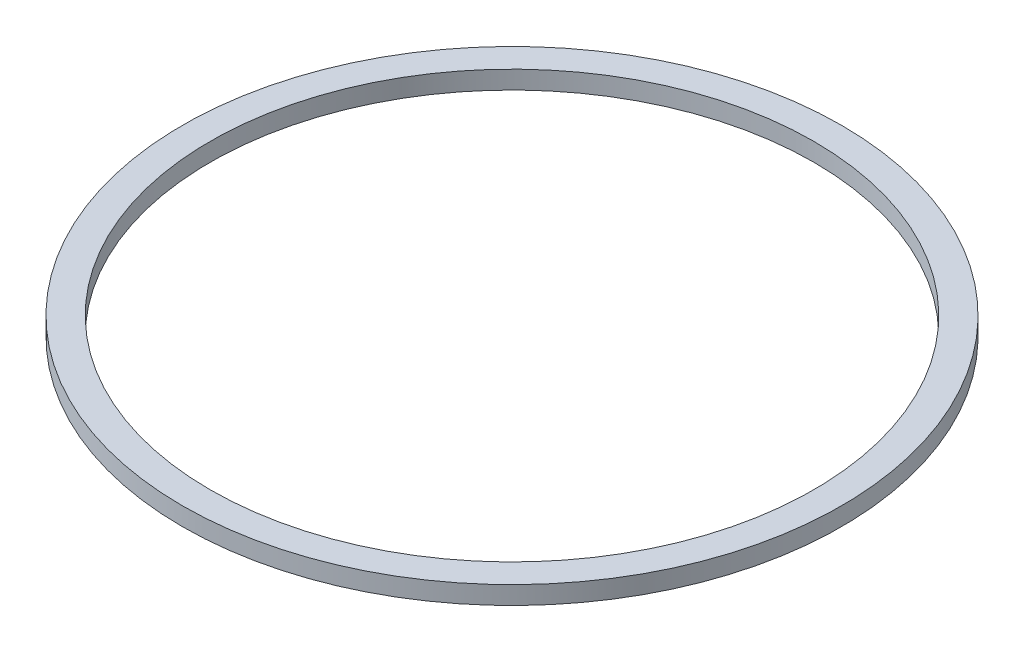
ISO-10303-21;
HEADER;
FILE_DESCRIPTION(('STEP AP214'),'2;1');
FILE_NAME('part.step','',(''),(''),'','','');
FILE_SCHEMA(('AUTOMOTIVE_DESIGN { 1 0 10303 214 1 1 1 1 }'));
ENDSEC;
DATA;
#1=APPLICATION_CONTEXT('core data for automotive mechanical design processes');
#2=APPLICATION_PROTOCOL_DEFINITION('international standard','automotive_design',2000,#1);
#3=PRODUCT_CONTEXT('',#1,'mechanical');
#4=PRODUCT('Part','Part','',(#3));
#5=PRODUCT_RELATED_PRODUCT_CATEGORY('part','',(#4));
#6=PRODUCT_DEFINITION_FORMATION('','',#4);
#7=PRODUCT_DEFINITION_CONTEXT('part definition',#1,'design');
#8=PRODUCT_DEFINITION('design','',#6,#7);
#9=PRODUCT_DEFINITION_SHAPE('','',#8);
#10=(LENGTH_UNIT() NAMED_UNIT(*) SI_UNIT(.MILLI.,.METRE.));
#11=(NAMED_UNIT(*) PLANE_ANGLE_UNIT() SI_UNIT($,.RADIAN.));
#12=(NAMED_UNIT(*) SI_UNIT($,.STERADIAN.) SOLID_ANGLE_UNIT());
#13=UNCERTAINTY_MEASURE_WITH_UNIT(LENGTH_MEASURE(1.E-05),#10,'distance_accuracy_value','');
#14=(GEOMETRIC_REPRESENTATION_CONTEXT(3) GLOBAL_UNCERTAINTY_ASSIGNED_CONTEXT((#13)) GLOBAL_UNIT_ASSIGNED_CONTEXT((#10,
#11,#12)) REPRESENTATION_CONTEXT('',''));
#15=CARTESIAN_POINT('',(0.,0.,0.));
#16=DIRECTION('',(0.,0.,1.));
#17=DIRECTION('',(1.,0.,0.));
#18=AXIS2_PLACEMENT_3D('',#15,#16,#17);
#19=CARTESIAN_POINT('',(0.,1.5,0.));
#20=DIRECTION('',(0.,1.,0.));
#21=DIRECTION('',(0.,0.,1.));
#22=AXIS2_PLACEMENT_3D('',#19,#20,#21);
#23=PLANE('',#22);
#24=CARTESIAN_POINT('',(0.,1.5,0.));
#25=DIRECTION('',(0.,1.,0.));
#26=DIRECTION('',(0.,0.,1.));
#27=AXIS2_PLACEMENT_3D('',#24,#25,#26);
#28=CIRCLE('',#27,27.3);
#29=CARTESIAN_POINT('',(0.,1.5,27.3));
#30=VERTEX_POINT('',#29);
#31=EDGE_CURVE('E10',#30,#30,#28,.T.);
#32=ORIENTED_EDGE('',*,*,#31,.T.);
#33=EDGE_LOOP('',(#32));
#34=FACE_BOUND('',#33,.T.);
#35=CARTESIAN_POINT('',(0.,1.5,0.));
#36=DIRECTION('',(0.,1.,0.));
#37=DIRECTION('',(0.,0.,1.));
#38=AXIS2_PLACEMENT_3D('',#35,#36,#37);
#39=CIRCLE('',#38,25.);
#40=CARTESIAN_POINT('',(0.,1.5,25.));
#41=VERTEX_POINT('',#40);
#42=EDGE_CURVE('E54',#41,#41,#39,.T.);
#43=ORIENTED_EDGE('',*,*,#42,.F.);
#44=EDGE_LOOP('',(#43));
#45=FACE_BOUND('',#44,.T.);
#46=ADVANCED_FACE('F41',(#34,#45),#23,.T.);
#47=CARTESIAN_POINT('',(0.,0.,0.));
#48=DIRECTION('',(0.,1.,0.));
#49=DIRECTION('',(0.,0.,1.));
#50=AXIS2_PLACEMENT_3D('',#47,#48,#49);
#51=PLANE('',#50);
#52=CARTESIAN_POINT('',(0.,0.,0.));
#53=DIRECTION('',(0.,1.,0.));
#54=DIRECTION('',(0.,0.,1.));
#55=AXIS2_PLACEMENT_3D('',#52,#53,#54);
#56=CIRCLE('',#55,27.3);
#57=CARTESIAN_POINT('',(0.,0.,27.3));
#58=VERTEX_POINT('',#57);
#59=EDGE_CURVE('E45',#58,#58,#56,.T.);
#60=ORIENTED_EDGE('',*,*,#59,.F.);
#61=EDGE_LOOP('',(#60));
#62=FACE_BOUND('',#61,.T.);
#63=CARTESIAN_POINT('',(0.,0.,0.));
#64=DIRECTION('',(0.,1.,0.));
#65=DIRECTION('',(0.,0.,1.));
#66=AXIS2_PLACEMENT_3D('',#63,#64,#65);
#67=CIRCLE('',#66,25.);
#68=CARTESIAN_POINT('',(0.,0.,25.));
#69=VERTEX_POINT('',#68);
#70=EDGE_CURVE('E56',#69,#69,#67,.T.);
#71=ORIENTED_EDGE('',*,*,#70,.T.);
#72=EDGE_LOOP('',(#71));
#73=FACE_BOUND('',#72,.T.);
#74=ADVANCED_FACE('F68',(#62,#73),#51,.F.);
#75=CARTESIAN_POINT('',(0.,1.5,0.));
#76=DIRECTION('',(0.,-1.,0.));
#77=DIRECTION('',(0.,0.,-1.));
#78=AXIS2_PLACEMENT_3D('',#75,#76,#77);
#79=CYLINDRICAL_SURFACE('',#78,27.3);
#80=ORIENTED_EDGE('',*,*,#31,.F.);
#81=EDGE_LOOP('',(#80));
#82=FACE_BOUND('',#81,.T.);
#83=ORIENTED_EDGE('',*,*,#59,.T.);
#84=EDGE_LOOP('',(#83));
#85=FACE_BOUND('',#84,.T.);
#86=ADVANCED_FACE('F43',(#82,#85),#79,.T.);
#87=CARTESIAN_POINT('',(0.,1.5,0.));
#88=DIRECTION('',(0.,-1.,0.));
#89=DIRECTION('',(0.,0.,-1.));
#90=AXIS2_PLACEMENT_3D('',#87,#88,#89);
#91=CYLINDRICAL_SURFACE('',#90,25.);
#92=ORIENTED_EDGE('',*,*,#42,.T.);
#93=EDGE_LOOP('',(#92));
#94=FACE_BOUND('',#93,.T.);
#95=ORIENTED_EDGE('',*,*,#70,.F.);
#96=EDGE_LOOP('',(#95));
#97=FACE_BOUND('',#96,.T.);
#98=ADVANCED_FACE('F64',(#94,#97),#91,.F.);
#99=CLOSED_SHELL('',(#46,#74,#86,#98));
#100=MANIFOLD_SOLID_BREP('B2',#99);
#101=ADVANCED_BREP_SHAPE_REPRESENTATION('',(#18,#100),#14);
#102=SHAPE_DEFINITION_REPRESENTATION(#9,#101);
ENDSEC;
END-ISO-10303-21;
